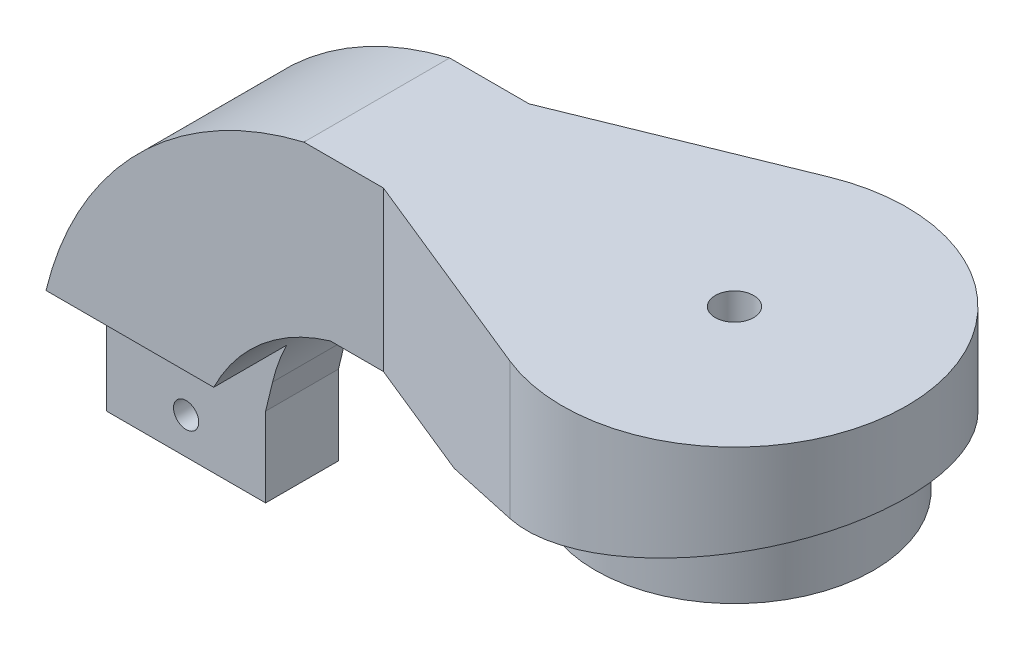
ISO-10303-21;
HEADER;
FILE_DESCRIPTION(('STEP AP214'),'2;1');
FILE_NAME('part.step','',(''),(''),'','','');
FILE_SCHEMA(('AUTOMOTIVE_DESIGN { 1 0 10303 214 1 1 1 1 }'));
ENDSEC;
DATA;
#1=APPLICATION_CONTEXT('core data for automotive mechanical design processes');
#2=APPLICATION_PROTOCOL_DEFINITION('international standard','automotive_design',2000,#1);
#3=PRODUCT_CONTEXT('',#1,'mechanical');
#4=PRODUCT('Part','Part','',(#3));
#5=PRODUCT_RELATED_PRODUCT_CATEGORY('part','',(#4));
#6=PRODUCT_DEFINITION_FORMATION('','',#4);
#7=PRODUCT_DEFINITION_CONTEXT('part definition',#1,'design');
#8=PRODUCT_DEFINITION('design','',#6,#7);
#9=PRODUCT_DEFINITION_SHAPE('','',#8);
#10=(LENGTH_UNIT() NAMED_UNIT(*) SI_UNIT(.MILLI.,.METRE.));
#11=(NAMED_UNIT(*) PLANE_ANGLE_UNIT() SI_UNIT($,.RADIAN.));
#12=(NAMED_UNIT(*) SI_UNIT($,.STERADIAN.) SOLID_ANGLE_UNIT());
#13=UNCERTAINTY_MEASURE_WITH_UNIT(LENGTH_MEASURE(1.E-05),#10,'distance_accuracy_value','');
#14=(GEOMETRIC_REPRESENTATION_CONTEXT(3) GLOBAL_UNCERTAINTY_ASSIGNED_CONTEXT((#13)) GLOBAL_UNIT_ASSIGNED_CONTEXT((#10,
#11,#12)) REPRESENTATION_CONTEXT('',''));
#15=CARTESIAN_POINT('',(0.,0.,0.));
#16=DIRECTION('',(0.,0.,1.));
#17=DIRECTION('',(1.,0.,0.));
#18=AXIS2_PLACEMENT_3D('',#15,#16,#17);
#19=CARTESIAN_POINT('',(-42.,24.,11.));
#20=DIRECTION('',(0.376404535641538,0.,-0.926455409368675));
#21=DIRECTION('',(-0.926455409368675,0.,-0.376404535641538));
#22=AXIS2_PLACEMENT_3D('',#19,#20,#21);
#23=PLANE('',#22);
#24=DIRECTION('',(0.926455409368675,0.,0.376404535641538));
#25=VECTOR('',#24,1.);
#26=CARTESIAN_POINT('',(-42.,0.,11.));
#27=LINE('',#26,#25);
#28=CARTESIAN_POINT('',(-42.,0.,11.));
#29=VERTEX_POINT('',#28);
#30=CARTESIAN_POINT('',(-24.,0.,18.3131222215699));
#31=VERTEX_POINT('',#30);
#32=EDGE_CURVE('E322',#29,#31,#27,.T.);
#33=ORIENTED_EDGE('',*,*,#32,.T.);
#34=DIRECTION('',(0.904369439054215,0.217048665373012,0.367431346736448));
#35=VECTOR('',#34,1.);
#36=CARTESIAN_POINT('',(-36.4410054694558,-2.98584131266938,13.258533690606));
#37=LINE('',#36,#35);
#38=CARTESIAN_POINT('',(-9.78651792667998,3.41123569759681,24.0878406435855));
#39=VERTEX_POINT('',#38);
#40=EDGE_CURVE('E57',#31,#39,#37,.T.);
#41=ORIENTED_EDGE('',*,*,#40,.T.);
#42=DIRECTION('',(0.,-1.,0.));
#43=VECTOR('',#42,1.);
#44=CARTESIAN_POINT('',(-9.78651792667998,24.,24.0878406435855));
#45=LINE('',#44,#43);
#46=CARTESIAN_POINT('',(-9.78651792667998,24.,24.0878406435855));
#47=VERTEX_POINT('',#46);
#48=EDGE_CURVE('E339',#47,#39,#45,.T.);
#49=ORIENTED_EDGE('',*,*,#48,.F.);
#50=DIRECTION('',(0.926455409368675,0.,0.376404535641538));
#51=VECTOR('',#50,1.);
#52=CARTESIAN_POINT('',(-42.,24.,11.));
#53=LINE('',#52,#51);
#54=CARTESIAN_POINT('',(-42.,24.,11.));
#55=VERTEX_POINT('',#54);
#56=EDGE_CURVE('E323',#55,#47,#53,.T.);
#57=ORIENTED_EDGE('',*,*,#56,.F.);
#58=DIRECTION('',(0.,-1.,0.));
#59=VECTOR('',#58,1.);
#60=CARTESIAN_POINT('',(-42.,24.,11.));
#61=LINE('',#60,#59);
#62=EDGE_CURVE('E42',#55,#29,#61,.T.);
#63=ORIENTED_EDGE('',*,*,#62,.T.);
#64=EDGE_LOOP('',(#33,#41,#49,#57,#63));
#65=FACE_BOUND('',#64,.T.);
#66=ADVANCED_FACE('F34',(#65),#23,.F.);
#67=CARTESIAN_POINT('',(0.,24.,0.));
#68=DIRECTION('',(0.,-1.,0.));
#69=DIRECTION('',(0.,0.,-1.));
#70=AXIS2_PLACEMENT_3D('',#67,#68,#69);
#71=CYLINDRICAL_SURFACE('',#70,26.);
#72=ORIENTED_EDGE('',*,*,#48,.T.);
#73=CARTESIAN_POINT('',(0.,5.76,0.));
#74=DIRECTION('',(-0.233372952475324,0.972387301980517,0.));
#75=DIRECTION('',(-0.972387301980518,-0.233372952475324,0.));
#76=AXIS2_PLACEMENT_3D('',#73,#74,#75);
#77=ELLIPSE('',#76,26.7383170749395,26.);
#78=CARTESIAN_POINT('',(-9.78651792667997,3.4112356975968,-24.0878406435855));
#79=VERTEX_POINT('',#78);
#80=EDGE_CURVE('E319',#39,#79,#77,.T.);
#81=ORIENTED_EDGE('',*,*,#80,.T.);
#82=DIRECTION('',(0.,-1.,0.));
#83=VECTOR('',#82,1.);
#84=CARTESIAN_POINT('',(-9.78651792667998,24.,-24.0878406435855));
#85=LINE('',#84,#83);
#86=CARTESIAN_POINT('',(-9.78651792667998,24.,-24.0878406435855));
#87=VERTEX_POINT('',#86);
#88=EDGE_CURVE('E336',#87,#79,#85,.T.);
#89=ORIENTED_EDGE('',*,*,#88,.F.);
#90=CARTESIAN_POINT('',(0.,24.,0.));
#91=DIRECTION('',(0.,1.,0.));
#92=DIRECTION('',(0.,0.,1.));
#93=AXIS2_PLACEMENT_3D('',#90,#91,#92);
#94=CIRCLE('',#93,26.);
#95=EDGE_CURVE('E325',#47,#87,#94,.T.);
#96=ORIENTED_EDGE('',*,*,#95,.F.);
#97=EDGE_LOOP('',(#72,#81,#89,#96));
#98=FACE_BOUND('',#97,.T.);
#99=ADVANCED_FACE('F369',(#98),#71,.T.);
#100=CARTESIAN_POINT('',(-42.,24.,-11.));
#101=DIRECTION('',(0.376404535641538,0.,0.926455409368675));
#102=DIRECTION('',(0.926455409368675,0.,-0.376404535641538));
#103=AXIS2_PLACEMENT_3D('',#100,#101,#102);
#104=PLANE('',#103);
#105=ORIENTED_EDGE('',*,*,#88,.T.);
#106=DIRECTION('',(-0.904369439054215,-0.217048665373012,0.367431346736448));
#107=VECTOR('',#106,1.);
#108=CARTESIAN_POINT('',(-36.4410054694558,-2.98584131266938,-13.258533690606));
#109=LINE('',#108,#107);
#110=CARTESIAN_POINT('',(-24.,0.,-18.3131222215699));
#111=VERTEX_POINT('',#110);
#112=EDGE_CURVE('E316',#79,#111,#109,.T.);
#113=ORIENTED_EDGE('',*,*,#112,.T.);
#114=DIRECTION('',(-0.926455409368675,0.,0.376404535641538));
#115=VECTOR('',#114,1.);
#116=CARTESIAN_POINT('',(-42.,0.,-11.));
#117=LINE('',#116,#115);
#118=CARTESIAN_POINT('',(-42.,0.,-11.));
#119=VERTEX_POINT('',#118);
#120=EDGE_CURVE('E326',#111,#119,#117,.T.);
#121=ORIENTED_EDGE('',*,*,#120,.T.);
#122=DIRECTION('',(0.,-1.,0.));
#123=VECTOR('',#122,1.);
#124=CARTESIAN_POINT('',(-42.,24.,-11.));
#125=LINE('',#124,#123);
#126=CARTESIAN_POINT('',(-42.,24.,-11.));
#127=VERTEX_POINT('',#126);
#128=EDGE_CURVE('E330',#127,#119,#125,.T.);
#129=ORIENTED_EDGE('',*,*,#128,.F.);
#130=DIRECTION('',(-0.926455409368675,0.,0.376404535641538));
#131=VECTOR('',#130,1.);
#132=CARTESIAN_POINT('',(-42.,24.,-11.));
#133=LINE('',#132,#131);
#134=EDGE_CURVE('E328',#87,#127,#133,.T.);
#135=ORIENTED_EDGE('',*,*,#134,.F.);
#136=EDGE_LOOP('',(#105,#113,#121,#129,#135));
#137=FACE_BOUND('',#136,.T.);
#138=ADVANCED_FACE('F363',(#137),#104,.F.);
#139=CARTESIAN_POINT('',(0.,24.,0.));
#140=DIRECTION('',(0.,1.,0.));
#141=DIRECTION('',(0.,0.,1.));
#142=AXIS2_PLACEMENT_3D('',#139,#140,#141);
#143=PLANE('',#142);
#144=CARTESIAN_POINT('',(0.,24.,0.));
#145=DIRECTION('',(0.,1.,0.));
#146=DIRECTION('',(0.,0.,1.));
#147=AXIS2_PLACEMENT_3D('',#144,#145,#146);
#148=CIRCLE('',#147,2.9);
#149=CARTESIAN_POINT('',(0.,24.,2.9));
#150=VERTEX_POINT('',#149);
#151=EDGE_CURVE('E217',#150,#150,#148,.T.);
#152=ORIENTED_EDGE('',*,*,#151,.F.);
#153=EDGE_LOOP('',(#152));
#154=FACE_BOUND('',#153,.T.);
#155=ORIENTED_EDGE('',*,*,#134,.T.);
#156=DIRECTION('',(-1.,0.,0.));
#157=VECTOR('',#156,1.);
#158=CARTESIAN_POINT('',(0.,24.,-11.));
#159=LINE('',#158,#157);
#160=CARTESIAN_POINT('',(-54.,24.,-11.));
#161=VERTEX_POINT('',#160);
#162=EDGE_CURVE('E226',#127,#161,#159,.T.);
#163=ORIENTED_EDGE('',*,*,#162,.T.);
#164=DIRECTION('',(0.,0.,-1.));
#165=VECTOR('',#164,1.);
#166=CARTESIAN_POINT('',(-54.,24.,11.));
#167=LINE('',#166,#165);
#168=CARTESIAN_POINT('',(-54.,24.,11.));
#169=VERTEX_POINT('',#168);
#170=EDGE_CURVE('E233',#169,#161,#167,.T.);
#171=ORIENTED_EDGE('',*,*,#170,.F.);
#172=DIRECTION('',(-1.,0.,0.));
#173=VECTOR('',#172,1.);
#174=CARTESIAN_POINT('',(0.,24.,11.));
#175=LINE('',#174,#173);
#176=EDGE_CURVE('E231',#55,#169,#175,.T.);
#177=ORIENTED_EDGE('',*,*,#176,.F.);
#178=ORIENTED_EDGE('',*,*,#56,.T.);
#179=ORIENTED_EDGE('',*,*,#95,.T.);
#180=EDGE_LOOP('',(#155,#163,#171,#177,#178,#179));
#181=FACE_BOUND('',#180,.T.);
#182=ADVANCED_FACE('F371',(#154,#181),#143,.T.);
#183=CARTESIAN_POINT('',(0.,0.,0.));
#184=DIRECTION('',(0.,1.,0.));
#185=DIRECTION('',(0.,0.,1.));
#186=AXIS2_PLACEMENT_3D('',#183,#184,#185);
#187=PLANE('',#186);
#188=ORIENTED_EDGE('',*,*,#120,.F.);
#189=DIRECTION('',(0.,0.,1.));
#190=VECTOR('',#189,1.);
#191=CARTESIAN_POINT('',(-24.,0.,0.));
#192=LINE('',#191,#190);
#193=EDGE_CURVE('E11',#111,#31,#192,.T.);
#194=ORIENTED_EDGE('',*,*,#193,.T.);
#195=ORIENTED_EDGE('',*,*,#32,.F.);
#196=DIRECTION('',(-1.,0.,0.));
#197=VECTOR('',#196,1.);
#198=CARTESIAN_POINT('',(0.,0.,11.));
#199=LINE('',#198,#197);
#200=CARTESIAN_POINT('',(-50.,0.,11.));
#201=VERTEX_POINT('',#200);
#202=EDGE_CURVE('E228',#29,#201,#199,.T.);
#203=ORIENTED_EDGE('',*,*,#202,.T.);
#204=DIRECTION('',(0.,0.,-1.));
#205=VECTOR('',#204,1.);
#206=CARTESIAN_POINT('',(-50.,0.,11.));
#207=LINE('',#206,#205);
#208=CARTESIAN_POINT('',(-50.,0.,-11.));
#209=VERTEX_POINT('',#208);
#210=EDGE_CURVE('E257',#201,#209,#207,.T.);
#211=ORIENTED_EDGE('',*,*,#210,.T.);
#212=DIRECTION('',(-1.,0.,0.));
#213=VECTOR('',#212,1.);
#214=CARTESIAN_POINT('',(0.,0.,-11.));
#215=LINE('',#214,#213);
#216=EDGE_CURVE('E251',#119,#209,#215,.T.);
#217=ORIENTED_EDGE('',*,*,#216,.F.);
#218=EDGE_LOOP('',(#188,#194,#195,#203,#211,#217));
#219=FACE_BOUND('',#218,.T.);
#220=ADVANCED_FACE('F351',(#219),#187,.F.);
#221=CARTESIAN_POINT('',(-24.,0.,-29.5));
#222=DIRECTION('',(-0.233372952475324,0.972387301980517,0.));
#223=DIRECTION('',(-0.972387301980518,-0.233372952475324,0.));
#224=AXIS2_PLACEMENT_3D('',#221,#222,#223);
#225=PLANE('',#224);
#226=CARTESIAN_POINT('',(0.,5.76,0.));
#227=DIRECTION('',(-0.233372952475324,0.972387301980517,0.));
#228=DIRECTION('',(0.972387301980518,0.233372952475324,0.));
#229=AXIS2_PLACEMENT_3D('',#226,#227,#228);
#230=ELLIPSE('',#229,21.5963330220665,21.);
#231=CARTESIAN_POINT('',(21.,10.8,0.));
#232=VERTEX_POINT('',#231);
#233=EDGE_CURVE('E37',#232,#232,#230,.T.);
#234=ORIENTED_EDGE('',*,*,#233,.T.);
#235=EDGE_LOOP('',(#234));
#236=FACE_BOUND('',#235,.T.);
#237=ORIENTED_EDGE('',*,*,#193,.F.);
#238=ORIENTED_EDGE('',*,*,#112,.F.);
#239=ORIENTED_EDGE('',*,*,#80,.F.);
#240=ORIENTED_EDGE('',*,*,#40,.F.);
#241=EDGE_LOOP('',(#237,#238,#239,#240));
#242=FACE_BOUND('',#241,.T.);
#243=ADVANCED_FACE('F366',(#236,#242),#225,.F.);
#244=CARTESIAN_POINT('',(0.,0.,0.));
#245=DIRECTION('',(0.,1.,0.));
#246=DIRECTION('',(0.,0.,1.));
#247=AXIS2_PLACEMENT_3D('',#244,#245,#246);
#248=CYLINDRICAL_SURFACE('',#247,21.);
#249=CARTESIAN_POINT('',(0.,0.,0.));
#250=DIRECTION('',(0.,1.,0.));
#251=DIRECTION('',(0.,0.,1.));
#252=AXIS2_PLACEMENT_3D('',#249,#250,#251);
#253=CIRCLE('',#252,21.);
#254=CARTESIAN_POINT('',(0.,0.,21.));
#255=VERTEX_POINT('',#254);
#256=EDGE_CURVE('E304',#255,#255,#253,.T.);
#257=ORIENTED_EDGE('',*,*,#256,.T.);
#258=EDGE_LOOP('',(#257));
#259=FACE_BOUND('',#258,.T.);
#260=ORIENTED_EDGE('',*,*,#233,.F.);
#261=EDGE_LOOP('',(#260));
#262=FACE_BOUND('',#261,.T.);
#263=ADVANCED_FACE('F422',(#259,#262),#248,.T.);
#264=CARTESIAN_POINT('',(0.,0.,0.));
#265=DIRECTION('',(0.,1.,0.));
#266=DIRECTION('',(0.,0.,1.));
#267=AXIS2_PLACEMENT_3D('',#264,#265,#266);
#268=PLANE('',#267);
#269=DIRECTION('',(-1.,0.,0.));
#270=VECTOR('',#269,1.);
#271=CARTESIAN_POINT('',(2.82901631902917,0.,4.9));
#272=LINE('',#271,#270);
#273=CARTESIAN_POINT('',(2.82901631902917,0.,4.9));
#274=VERTEX_POINT('',#273);
#275=CARTESIAN_POINT('',(-2.82901631902917,0.,4.9));
#276=VERTEX_POINT('',#275);
#277=EDGE_CURVE('E288',#274,#276,#272,.T.);
#278=ORIENTED_EDGE('',*,*,#277,.F.);
#279=DIRECTION('',(-0.5,0.,0.866025403784439));
#280=VECTOR('',#279,1.);
#281=CARTESIAN_POINT('',(5.65803263805833,0.,0.));
#282=LINE('',#281,#280);
#283=CARTESIAN_POINT('',(5.65803263805833,0.,0.));
#284=VERTEX_POINT('',#283);
#285=EDGE_CURVE('E49',#284,#274,#282,.T.);
#286=ORIENTED_EDGE('',*,*,#285,.F.);
#287=DIRECTION('',(0.5,0.,0.866025403784439));
#288=VECTOR('',#287,1.);
#289=CARTESIAN_POINT('',(2.82901631902916,0.,-4.9));
#290=LINE('',#289,#288);
#291=CARTESIAN_POINT('',(2.82901631902916,0.,-4.9));
#292=VERTEX_POINT('',#291);
#293=EDGE_CURVE('E271',#292,#284,#290,.T.);
#294=ORIENTED_EDGE('',*,*,#293,.F.);
#295=DIRECTION('',(1.,0.,0.));
#296=VECTOR('',#295,1.);
#297=CARTESIAN_POINT('',(-2.82901631902917,0.,-4.9));
#298=LINE('',#297,#296);
#299=CARTESIAN_POINT('',(-2.82901631902917,0.,-4.9));
#300=VERTEX_POINT('',#299);
#301=EDGE_CURVE('E297',#300,#292,#298,.T.);
#302=ORIENTED_EDGE('',*,*,#301,.F.);
#303=DIRECTION('',(0.5,0.,-0.866025403784439));
#304=VECTOR('',#303,1.);
#305=CARTESIAN_POINT('',(-5.65803263805833,0.,0.));
#306=LINE('',#305,#304);
#307=CARTESIAN_POINT('',(-5.65803263805833,0.,0.));
#308=VERTEX_POINT('',#307);
#309=EDGE_CURVE('E294',#308,#300,#306,.T.);
#310=ORIENTED_EDGE('',*,*,#309,.F.);
#311=DIRECTION('',(-0.5,0.,-0.866025403784439));
#312=VECTOR('',#311,1.);
#313=CARTESIAN_POINT('',(-2.82901631902917,0.,4.9));
#314=LINE('',#313,#312);
#315=EDGE_CURVE('E291',#276,#308,#314,.T.);
#316=ORIENTED_EDGE('',*,*,#315,.F.);
#317=EDGE_LOOP('',(#278,#286,#294,#302,#310,#316));
#318=FACE_BOUND('',#317,.T.);
#319=ORIENTED_EDGE('',*,*,#256,.F.);
#320=EDGE_LOOP('',(#319));
#321=FACE_BOUND('',#320,.T.);
#322=ADVANCED_FACE('F426',(#318,#321),#268,.F.);
#323=CARTESIAN_POINT('',(5.65803263805833,4.,0.));
#324=DIRECTION('',(0.866025403784439,0.,0.5));
#325=DIRECTION('',(0.5,0.,-0.866025403784439));
#326=AXIS2_PLACEMENT_3D('',#323,#324,#325);
#327=PLANE('',#326);
#328=ORIENTED_EDGE('',*,*,#285,.T.);
#329=DIRECTION('',(0.,-1.,0.));
#330=VECTOR('',#329,1.);
#331=CARTESIAN_POINT('',(2.82901631902917,4.,4.9));
#332=LINE('',#331,#330);
#333=CARTESIAN_POINT('',(2.82901631902917,4.,4.9));
#334=VERTEX_POINT('',#333);
#335=EDGE_CURVE('E286',#334,#274,#332,.T.);
#336=ORIENTED_EDGE('',*,*,#335,.F.);
#337=DIRECTION('',(-0.5,0.,0.866025403784439));
#338=VECTOR('',#337,1.);
#339=CARTESIAN_POINT('',(5.65803263805833,4.,0.));
#340=LINE('',#339,#338);
#341=CARTESIAN_POINT('',(5.65803263805833,4.,0.));
#342=VERTEX_POINT('',#341);
#343=EDGE_CURVE('E267',#342,#334,#340,.T.);
#344=ORIENTED_EDGE('',*,*,#343,.F.);
#345=DIRECTION('',(0.,-1.,0.));
#346=VECTOR('',#345,1.);
#347=CARTESIAN_POINT('',(5.65803263805833,4.,0.));
#348=LINE('',#347,#346);
#349=EDGE_CURVE('E302',#342,#284,#348,.T.);
#350=ORIENTED_EDGE('',*,*,#349,.T.);
#351=EDGE_LOOP('',(#328,#336,#344,#350));
#352=FACE_BOUND('',#351,.T.);
#353=ADVANCED_FACE('F430',(#352),#327,.F.);
#354=CARTESIAN_POINT('',(2.82901631902916,4.,-4.9));
#355=DIRECTION('',(0.866025403784439,0.,-0.5));
#356=DIRECTION('',(-0.5,0.,-0.866025403784439));
#357=AXIS2_PLACEMENT_3D('',#354,#355,#356);
#358=PLANE('',#357);
#359=ORIENTED_EDGE('',*,*,#293,.T.);
#360=ORIENTED_EDGE('',*,*,#349,.F.);
#361=DIRECTION('',(0.5,0.,0.866025403784439));
#362=VECTOR('',#361,1.);
#363=CARTESIAN_POINT('',(2.82901631902916,4.,-4.9));
#364=LINE('',#363,#362);
#365=CARTESIAN_POINT('',(2.82901631902916,4.,-4.9));
#366=VERTEX_POINT('',#365);
#367=EDGE_CURVE('E283',#366,#342,#364,.T.);
#368=ORIENTED_EDGE('',*,*,#367,.F.);
#369=DIRECTION('',(0.,-1.,0.));
#370=VECTOR('',#369,1.);
#371=CARTESIAN_POINT('',(2.82901631902916,4.,-4.9));
#372=LINE('',#371,#370);
#373=EDGE_CURVE('E305',#366,#292,#372,.T.);
#374=ORIENTED_EDGE('',*,*,#373,.T.);
#375=EDGE_LOOP('',(#359,#360,#368,#374));
#376=FACE_BOUND('',#375,.T.);
#377=ADVANCED_FACE('F434',(#376),#358,.F.);
#378=CARTESIAN_POINT('',(-2.82901631902917,4.,-4.9));
#379=DIRECTION('',(0.,0.,-1.));
#380=DIRECTION('',(-1.,0.,0.));
#381=AXIS2_PLACEMENT_3D('',#378,#379,#380);
#382=PLANE('',#381);
#383=ORIENTED_EDGE('',*,*,#301,.T.);
#384=ORIENTED_EDGE('',*,*,#373,.F.);
#385=DIRECTION('',(1.,0.,0.));
#386=VECTOR('',#385,1.);
#387=CARTESIAN_POINT('',(-2.82901631902917,4.,-4.9));
#388=LINE('',#387,#386);
#389=CARTESIAN_POINT('',(-2.82901631902917,4.,-4.9));
#390=VERTEX_POINT('',#389);
#391=EDGE_CURVE('E280',#390,#366,#388,.T.);
#392=ORIENTED_EDGE('',*,*,#391,.F.);
#393=DIRECTION('',(0.,-1.,0.));
#394=VECTOR('',#393,1.);
#395=CARTESIAN_POINT('',(-2.82901631902917,4.,-4.9));
#396=LINE('',#395,#394);
#397=EDGE_CURVE('E307',#390,#300,#396,.T.);
#398=ORIENTED_EDGE('',*,*,#397,.T.);
#399=EDGE_LOOP('',(#383,#384,#392,#398));
#400=FACE_BOUND('',#399,.T.);
#401=ADVANCED_FACE('F447',(#400),#382,.F.);
#402=CARTESIAN_POINT('',(-5.65803263805833,4.,0.));
#403=DIRECTION('',(-0.866025403784439,0.,-0.5));
#404=DIRECTION('',(-0.5,0.,0.866025403784439));
#405=AXIS2_PLACEMENT_3D('',#402,#403,#404);
#406=PLANE('',#405);
#407=ORIENTED_EDGE('',*,*,#309,.T.);
#408=ORIENTED_EDGE('',*,*,#397,.F.);
#409=DIRECTION('',(0.5,0.,-0.866025403784439));
#410=VECTOR('',#409,1.);
#411=CARTESIAN_POINT('',(-5.65803263805833,4.,0.));
#412=LINE('',#411,#410);
#413=CARTESIAN_POINT('',(-5.65803263805833,4.,0.));
#414=VERTEX_POINT('',#413);
#415=EDGE_CURVE('E277',#414,#390,#412,.T.);
#416=ORIENTED_EDGE('',*,*,#415,.F.);
#417=DIRECTION('',(0.,-1.,0.));
#418=VECTOR('',#417,1.);
#419=CARTESIAN_POINT('',(-5.65803263805833,4.,0.));
#420=LINE('',#419,#418);
#421=EDGE_CURVE('E309',#414,#308,#420,.T.);
#422=ORIENTED_EDGE('',*,*,#421,.T.);
#423=EDGE_LOOP('',(#407,#408,#416,#422));
#424=FACE_BOUND('',#423,.T.);
#425=ADVANCED_FACE('F443',(#424),#406,.F.);
#426=CARTESIAN_POINT('',(-2.82901631902917,4.,4.9));
#427=DIRECTION('',(-0.866025403784439,0.,0.5));
#428=DIRECTION('',(0.5,0.,0.866025403784439));
#429=AXIS2_PLACEMENT_3D('',#426,#427,#428);
#430=PLANE('',#429);
#431=ORIENTED_EDGE('',*,*,#315,.T.);
#432=ORIENTED_EDGE('',*,*,#421,.F.);
#433=DIRECTION('',(-0.5,0.,-0.866025403784439));
#434=VECTOR('',#433,1.);
#435=CARTESIAN_POINT('',(-2.82901631902917,4.,4.9));
#436=LINE('',#435,#434);
#437=CARTESIAN_POINT('',(-2.82901631902917,4.,4.9));
#438=VERTEX_POINT('',#437);
#439=EDGE_CURVE('E274',#438,#414,#436,.T.);
#440=ORIENTED_EDGE('',*,*,#439,.F.);
#441=DIRECTION('',(0.,-1.,0.));
#442=VECTOR('',#441,1.);
#443=CARTESIAN_POINT('',(-2.82901631902917,4.,4.9));
#444=LINE('',#443,#442);
#445=EDGE_CURVE('E311',#438,#276,#444,.T.);
#446=ORIENTED_EDGE('',*,*,#445,.T.);
#447=EDGE_LOOP('',(#431,#432,#440,#446));
#448=FACE_BOUND('',#447,.T.);
#449=ADVANCED_FACE('F439',(#448),#430,.F.);
#450=CARTESIAN_POINT('',(2.82901631902917,4.,4.9));
#451=DIRECTION('',(0.,0.,1.));
#452=DIRECTION('',(1.,0.,0.));
#453=AXIS2_PLACEMENT_3D('',#450,#451,#452);
#454=PLANE('',#453);
#455=ORIENTED_EDGE('',*,*,#277,.T.);
#456=ORIENTED_EDGE('',*,*,#445,.F.);
#457=DIRECTION('',(-1.,0.,0.));
#458=VECTOR('',#457,1.);
#459=CARTESIAN_POINT('',(2.82901631902917,4.,4.9));
#460=LINE('',#459,#458);
#461=EDGE_CURVE('E270',#334,#438,#460,.T.);
#462=ORIENTED_EDGE('',*,*,#461,.F.);
#463=ORIENTED_EDGE('',*,*,#335,.T.);
#464=EDGE_LOOP('',(#455,#456,#462,#463));
#465=FACE_BOUND('',#464,.T.);
#466=ADVANCED_FACE('F435',(#465),#454,.F.);
#467=CARTESIAN_POINT('',(0.,4.,0.));
#468=DIRECTION('',(0.,-1.,0.));
#469=DIRECTION('',(0.,0.,-1.));
#470=AXIS2_PLACEMENT_3D('',#467,#468,#469);
#471=PLANE('',#470);
#472=CARTESIAN_POINT('',(0.,4.,0.));
#473=DIRECTION('',(0.,-1.,0.));
#474=DIRECTION('',(0.,0.,-1.));
#475=AXIS2_PLACEMENT_3D('',#472,#473,#474);
#476=CIRCLE('',#475,2.9);
#477=CARTESIAN_POINT('',(0.,4.,-2.9));
#478=VERTEX_POINT('',#477);
#479=EDGE_CURVE('E216',#478,#478,#476,.F.);
#480=ORIENTED_EDGE('',*,*,#479,.T.);
#481=EDGE_LOOP('',(#480));
#482=FACE_BOUND('',#481,.T.);
#483=ORIENTED_EDGE('',*,*,#343,.T.);
#484=ORIENTED_EDGE('',*,*,#461,.T.);
#485=ORIENTED_EDGE('',*,*,#439,.T.);
#486=ORIENTED_EDGE('',*,*,#415,.T.);
#487=ORIENTED_EDGE('',*,*,#391,.T.);
#488=ORIENTED_EDGE('',*,*,#367,.T.);
#489=EDGE_LOOP('',(#483,#484,#485,#486,#487,#488));
#490=FACE_BOUND('',#489,.T.);
#491=ADVANCED_FACE('F438',(#482,#490),#471,.T.);
#492=CARTESIAN_POINT('',(-41.7095894033961,-27.2551559973421,11.));
#493=DIRECTION('',(0.,0.,-1.));
#494=DIRECTION('',(-1.,0.,0.));
#495=AXIS2_PLACEMENT_3D('',#492,#493,#494);
#496=CYLINDRICAL_SURFACE('',#495,52.7081133123259);
#497=CARTESIAN_POINT('',(-41.7095894033961,-27.2551559973421,-11.));
#498=DIRECTION('',(0.,0.,1.));
#499=DIRECTION('',(1.,0.,0.));
#500=AXIS2_PLACEMENT_3D('',#497,#498,#499);
#501=CIRCLE('',#500,52.7081133123259);
#502=CARTESIAN_POINT('',(-92.9418253522618,-14.8695511019506,-11.));
#503=VERTEX_POINT('',#502);
#504=EDGE_CURVE('E220',#503,#161,#501,.F.);
#505=ORIENTED_EDGE('',*,*,#504,.F.);
#506=DIRECTION('',(0.,0.,-1.));
#507=VECTOR('',#506,1.);
#508=CARTESIAN_POINT('',(-92.9418253522618,-14.8695511019506,11.));
#509=LINE('',#508,#507);
#510=CARTESIAN_POINT('',(-92.9418253522618,-14.8695511019506,0.));
#511=VERTEX_POINT('',#510);
#512=EDGE_CURVE('E265',#511,#503,#509,.T.);
#513=ORIENTED_EDGE('',*,*,#512,.F.);
#514=CARTESIAN_POINT('',(-92.9418253522618,-14.8695511019506,11.));
#515=VERTEX_POINT('',#514);
#516=EDGE_CURVE('E179',#515,#511,#509,.T.);
#517=ORIENTED_EDGE('',*,*,#516,.F.);
#518=CARTESIAN_POINT('',(-41.7095894033961,-27.2551559973421,11.));
#519=DIRECTION('',(0.,0.,1.));
#520=DIRECTION('',(1.,0.,0.));
#521=AXIS2_PLACEMENT_3D('',#518,#519,#520);
#522=CIRCLE('',#521,52.7081133123259);
#523=EDGE_CURVE('E223',#515,#169,#522,.F.);
#524=ORIENTED_EDGE('',*,*,#523,.T.);
#525=ORIENTED_EDGE('',*,*,#170,.T.);
#526=EDGE_LOOP('',(#505,#513,#517,#524,#525));
#527=FACE_BOUND('',#526,.T.);
#528=ADVANCED_FACE('F375',(#527),#496,.T.);
#529=CARTESIAN_POINT('',(-84.4134977836503,20.4073121545938,11.));
#530=DIRECTION('',(0.971999047761113,-0.234984789191746,0.));
#531=DIRECTION('',(0.234984789191746,0.971999047761113,0.));
#532=AXIS2_PLACEMENT_3D('',#529,#530,#531);
#533=PLANE('',#532);
#534=DIRECTION('',(0.,0.,-1.));
#535=VECTOR('',#534,1.);
#536=CARTESIAN_POINT('',(-94.78651792668,-22.5,11.));
#537=LINE('',#536,#535);
#538=CARTESIAN_POINT('',(-94.78651792668,-22.5,0.));
#539=VERTEX_POINT('',#538);
#540=CARTESIAN_POINT('',(-94.78651792668,-22.5,-11.));
#541=VERTEX_POINT('',#540);
#542=EDGE_CURVE('E263',#539,#541,#537,.T.);
#543=ORIENTED_EDGE('',*,*,#542,.F.);
#544=DIRECTION('',(-0.234984789191746,-0.971999047761113,0.));
#545=VECTOR('',#544,1.);
#546=CARTESIAN_POINT('',(-86.374058126423,12.2975838917223,0.));
#547=LINE('',#546,#545);
#548=EDGE_CURVE('E210',#511,#539,#547,.T.);
#549=ORIENTED_EDGE('',*,*,#548,.F.);
#550=ORIENTED_EDGE('',*,*,#512,.T.);
#551=DIRECTION('',(-0.234984789191746,-0.971999047761113,0.));
#552=VECTOR('',#551,1.);
#553=CARTESIAN_POINT('',(-84.4134977836503,20.4073121545938,-11.));
#554=LINE('',#553,#552);
#555=EDGE_CURVE('E236',#503,#541,#554,.T.);
#556=ORIENTED_EDGE('',*,*,#555,.T.);
#557=EDGE_LOOP('',(#543,#549,#550,#556));
#558=FACE_BOUND('',#557,.T.);
#559=ADVANCED_FACE('F380',(#558),#533,.F.);
#560=CARTESIAN_POINT('',(-94.78651792668,0.,11.));
#561=DIRECTION('',(1.,0.,0.));
#562=DIRECTION('',(0.,0.,-1.));
#563=AXIS2_PLACEMENT_3D('',#560,#561,#562);
#564=PLANE('',#563);
#565=DIRECTION('',(0.,0.,-1.));
#566=VECTOR('',#565,1.);
#567=CARTESIAN_POINT('',(-94.78651792668,-37.0753078944646,11.));
#568=LINE('',#567,#566);
#569=CARTESIAN_POINT('',(-94.78651792668,-37.0753078944646,0.));
#570=VERTEX_POINT('',#569);
#571=CARTESIAN_POINT('',(-94.78651792668,-37.0753078944646,-11.));
#572=VERTEX_POINT('',#571);
#573=EDGE_CURVE('E196',#570,#572,#568,.T.);
#574=ORIENTED_EDGE('',*,*,#573,.F.);
#575=DIRECTION('',(0.,-1.,0.));
#576=VECTOR('',#575,1.);
#577=CARTESIAN_POINT('',(-94.78651792668,-14.8695511019506,0.));
#578=LINE('',#577,#576);
#579=EDGE_CURVE('E207',#539,#570,#578,.T.);
#580=ORIENTED_EDGE('',*,*,#579,.F.);
#581=ORIENTED_EDGE('',*,*,#542,.T.);
#582=DIRECTION('',(0.,-1.,0.));
#583=VECTOR('',#582,1.);
#584=CARTESIAN_POINT('',(-94.78651792668,0.,-11.));
#585=LINE('',#584,#583);
#586=EDGE_CURVE('E239',#541,#572,#585,.T.);
#587=ORIENTED_EDGE('',*,*,#586,.T.);
#588=EDGE_LOOP('',(#574,#580,#581,#587));
#589=FACE_BOUND('',#588,.T.);
#590=ADVANCED_FACE('F385',(#589),#564,.F.);
#591=CARTESIAN_POINT('',(-70.78651792668,0.,11.));
#592=DIRECTION('',(1.,0.,0.));
#593=DIRECTION('',(0.,0.,-1.));
#594=AXIS2_PLACEMENT_3D('',#591,#592,#593);
#595=PLANE('',#594);
#596=DIRECTION('',(0.,-1.,0.));
#597=VECTOR('',#596,1.);
#598=CARTESIAN_POINT('',(-70.78651792668,-14.8695511019506,0.));
#599=LINE('',#598,#597);
#600=CARTESIAN_POINT('',(-70.78651792668,-25.0753078944646,0.));
#601=VERTEX_POINT('',#600);
#602=CARTESIAN_POINT('',(-70.78651792668,-37.0753078944646,0.));
#603=VERTEX_POINT('',#602);
#604=EDGE_CURVE('E204',#601,#603,#599,.T.);
#605=ORIENTED_EDGE('',*,*,#604,.T.);
#606=DIRECTION('',(0.,0.,-1.));
#607=VECTOR('',#606,1.);
#608=CARTESIAN_POINT('',(-70.78651792668,-37.0753078944646,11.));
#609=LINE('',#608,#607);
#610=CARTESIAN_POINT('',(-70.78651792668,-37.0753078944646,-11.));
#611=VERTEX_POINT('',#610);
#612=EDGE_CURVE('E198',#603,#611,#609,.T.);
#613=ORIENTED_EDGE('',*,*,#612,.T.);
#614=DIRECTION('',(0.,-1.,0.));
#615=VECTOR('',#614,1.);
#616=CARTESIAN_POINT('',(-70.78651792668,0.,-11.));
#617=LINE('',#616,#615);
#618=CARTESIAN_POINT('',(-70.78651792668,-25.0753078944646,-11.));
#619=VERTEX_POINT('',#618);
#620=EDGE_CURVE('E242',#619,#611,#617,.T.);
#621=ORIENTED_EDGE('',*,*,#620,.F.);
#622=DIRECTION('',(0.,0.,-1.));
#623=VECTOR('',#622,1.);
#624=CARTESIAN_POINT('',(-70.78651792668,-25.0753078944646,11.));
#625=LINE('',#624,#623);
#626=EDGE_CURVE('E261',#601,#619,#625,.T.);
#627=ORIENTED_EDGE('',*,*,#626,.F.);
#628=EDGE_LOOP('',(#605,#613,#621,#627));
#629=FACE_BOUND('',#628,.T.);
#630=ADVANCED_FACE('F395',(#629),#595,.T.);
#631=CARTESIAN_POINT('',(-61.1505130339718,14.7833893946227,11.));
#632=DIRECTION('',(0.971999047761113,-0.234984789191746,0.));
#633=DIRECTION('',(0.234984789191746,0.971999047761113,0.));
#634=AXIS2_PLACEMENT_3D('',#631,#632,#633);
#635=PLANE('',#634);
#636=DIRECTION('',(-0.234984789191746,-0.971999047761113,0.));
#637=VECTOR('',#636,1.);
#638=CARTESIAN_POINT('',(-63.1110733767444,6.67366113175113,0.));
#639=LINE('',#638,#637);
#640=CARTESIAN_POINT('',(-69.7388628081069,-20.7417517475426,0.));
#641=VERTEX_POINT('',#640);
#642=EDGE_CURVE('E188',#641,#601,#639,.T.);
#643=ORIENTED_EDGE('',*,*,#642,.T.);
#644=ORIENTED_EDGE('',*,*,#626,.T.);
#645=DIRECTION('',(-0.234984789191746,-0.971999047761113,0.));
#646=VECTOR('',#645,1.);
#647=CARTESIAN_POINT('',(-61.1505130339718,14.7833893946227,-11.));
#648=LINE('',#647,#646);
#649=CARTESIAN_POINT('',(-69.7388628081069,-20.7417517475426,-11.));
#650=VERTEX_POINT('',#649);
#651=EDGE_CURVE('E245',#650,#619,#648,.T.);
#652=ORIENTED_EDGE('',*,*,#651,.F.);
#653=DIRECTION('',(0.,0.,-1.));
#654=VECTOR('',#653,1.);
#655=CARTESIAN_POINT('',(-69.7388628081069,-20.7417517475426,11.));
#656=LINE('',#655,#654);
#657=EDGE_CURVE('E259',#641,#650,#656,.T.);
#658=ORIENTED_EDGE('',*,*,#657,.F.);
#659=EDGE_LOOP('',(#643,#644,#652,#658));
#660=FACE_BOUND('',#659,.T.);
#661=ADVANCED_FACE('F397',(#660),#635,.T.);
#662=CARTESIAN_POINT('',(-41.8993681465749,-27.4720647034176,11.));
#663=DIRECTION('',(0.,0.,-1.));
#664=DIRECTION('',(-1.,0.,0.));
#665=AXIS2_PLACEMENT_3D('',#662,#663,#664);
#666=CYLINDRICAL_SURFACE('',#665,28.6414834722905);
#667=CARTESIAN_POINT('',(-41.8993681465749,-27.4720647034176,11.));
#668=DIRECTION('',(0.,0.,1.));
#669=DIRECTION('',(1.,0.,0.));
#670=AXIS2_PLACEMENT_3D('',#667,#668,#669);
#671=CIRCLE('',#670,28.6414834722905);
#672=CARTESIAN_POINT('',(-67.6192286908766,-14.8695511019506,11.));
#673=VERTEX_POINT('',#672);
#674=EDGE_CURVE('E195',#673,#201,#671,.F.);
#675=ORIENTED_EDGE('',*,*,#674,.F.);
#676=DIRECTION('',(0.,0.,-1.));
#677=VECTOR('',#676,1.);
#678=CARTESIAN_POINT('',(-67.6192286908766,-14.8695511019506,11.));
#679=LINE('',#678,#677);
#680=CARTESIAN_POINT('',(-67.6192286908766,-14.8695511019506,0.));
#681=VERTEX_POINT('',#680);
#682=EDGE_CURVE('E176',#681,#673,#679,.F.);
#683=ORIENTED_EDGE('',*,*,#682,.F.);
#684=CARTESIAN_POINT('',(-41.8993681465749,-27.4720647034176,0.));
#685=DIRECTION('',(0.,0.,-1.));
#686=DIRECTION('',(-1.,0.,0.));
#687=AXIS2_PLACEMENT_3D('',#684,#685,#686);
#688=CIRCLE('',#687,28.6414834722905);
#689=EDGE_CURVE('E185',#641,#681,#688,.T.);
#690=ORIENTED_EDGE('',*,*,#689,.F.);
#691=ORIENTED_EDGE('',*,*,#657,.T.);
#692=CARTESIAN_POINT('',(-41.8993681465749,-27.4720647034176,-11.));
#693=DIRECTION('',(0.,0.,1.));
#694=DIRECTION('',(1.,0.,0.));
#695=AXIS2_PLACEMENT_3D('',#692,#693,#694);
#696=CIRCLE('',#695,28.6414834722905);
#697=EDGE_CURVE('E248',#650,#209,#696,.F.);
#698=ORIENTED_EDGE('',*,*,#697,.T.);
#699=ORIENTED_EDGE('',*,*,#210,.F.);
#700=EDGE_LOOP('',(#675,#683,#690,#691,#698,#699));
#701=FACE_BOUND('',#700,.T.);
#702=ADVANCED_FACE('F193',(#701),#666,.F.);
#703=CARTESIAN_POINT('',(0.,0.,11.));
#704=DIRECTION('',(0.,0.,1.));
#705=DIRECTION('',(1.,0.,0.));
#706=AXIS2_PLACEMENT_3D('',#703,#704,#705);
#707=PLANE('',#706);
#708=DIRECTION('',(1.,0.,0.));
#709=VECTOR('',#708,1.);
#710=CARTESIAN_POINT('',(26.001,-14.8695511019506,11.));
#711=LINE('',#710,#709);
#712=EDGE_CURVE('E214',#515,#673,#711,.T.);
#713=ORIENTED_EDGE('',*,*,#712,.T.);
#714=ORIENTED_EDGE('',*,*,#674,.T.);
#715=ORIENTED_EDGE('',*,*,#202,.F.);
#716=ORIENTED_EDGE('',*,*,#62,.F.);
#717=ORIENTED_EDGE('',*,*,#176,.T.);
#718=ORIENTED_EDGE('',*,*,#523,.F.);
#719=EDGE_LOOP('',(#713,#714,#715,#716,#717,#718));
#720=FACE_BOUND('',#719,.T.);
#721=ADVANCED_FACE('F352',(#720),#707,.T.);
#722=CARTESIAN_POINT('',(0.,0.,-11.));
#723=DIRECTION('',(0.,0.,1.));
#724=DIRECTION('',(1.,0.,0.));
#725=AXIS2_PLACEMENT_3D('',#722,#723,#724);
#726=PLANE('',#725);
#727=CARTESIAN_POINT('',(-81.9601774293469,-20.3695511019506,-11.));
#728=DIRECTION('',(0.,0.,1.));
#729=DIRECTION('',(1.,0.,0.));
#730=AXIS2_PLACEMENT_3D('',#727,#728,#729);
#731=CIRCLE('',#730,1.9);
#732=CARTESIAN_POINT('',(-80.0601774293469,-20.3695511019506,-11.));
#733=VERTEX_POINT('',#732);
#734=EDGE_CURVE('E393',#733,#733,#731,.T.);
#735=ORIENTED_EDGE('',*,*,#734,.T.);
#736=EDGE_LOOP('',(#735));
#737=FACE_BOUND('',#736,.T.);
#738=CARTESIAN_POINT('',(-82.78651792668,-31.5753078944646,-11.));
#739=DIRECTION('',(0.,0.,1.));
#740=DIRECTION('',(1.,0.,0.));
#741=AXIS2_PLACEMENT_3D('',#738,#739,#740);
#742=CIRCLE('',#741,1.9);
#743=CARTESIAN_POINT('',(-80.88651792668,-31.5753078944646,-11.));
#744=VERTEX_POINT('',#743);
#745=EDGE_CURVE('E690',#744,#744,#742,.T.);
#746=ORIENTED_EDGE('',*,*,#745,.T.);
#747=EDGE_LOOP('',(#746));
#748=FACE_BOUND('',#747,.T.);
#749=ORIENTED_EDGE('',*,*,#620,.T.);
#750=DIRECTION('',(1.,0.,0.));
#751=VECTOR('',#750,1.);
#752=CARTESIAN_POINT('',(26.001,-37.0753078944646,-11.));
#753=LINE('',#752,#751);
#754=EDGE_CURVE('E212',#572,#611,#753,.T.);
#755=ORIENTED_EDGE('',*,*,#754,.F.);
#756=ORIENTED_EDGE('',*,*,#586,.F.);
#757=ORIENTED_EDGE('',*,*,#555,.F.);
#758=ORIENTED_EDGE('',*,*,#504,.T.);
#759=ORIENTED_EDGE('',*,*,#162,.F.);
#760=ORIENTED_EDGE('',*,*,#128,.T.);
#761=ORIENTED_EDGE('',*,*,#216,.T.);
#762=ORIENTED_EDGE('',*,*,#697,.F.);
#763=ORIENTED_EDGE('',*,*,#651,.T.);
#764=EDGE_LOOP('',(#749,#755,#756,#757,#758,#759,#760,#761,#762,#763));
#765=FACE_BOUND('',#764,.T.);
#766=ADVANCED_FACE('F357',(#737,#748,#765),#726,.F.);
#767=CARTESIAN_POINT('',(0.,-99.501,0.));
#768=DIRECTION('',(0.,1.,0.));
#769=DIRECTION('',(0.,0.,1.));
#770=AXIS2_PLACEMENT_3D('',#767,#768,#769);
#771=CYLINDRICAL_SURFACE('',#770,2.9);
#772=ORIENTED_EDGE('',*,*,#479,.F.);
#773=EDGE_LOOP('',(#772));
#774=FACE_BOUND('',#773,.T.);
#775=ORIENTED_EDGE('',*,*,#151,.T.);
#776=EDGE_LOOP('',(#775));
#777=FACE_BOUND('',#776,.T.);
#778=ADVANCED_FACE('F503',(#774,#777),#771,.F.);
#779=CARTESIAN_POINT('',(26.001,-14.8695511019506,34.5150950819672));
#780=DIRECTION('',(0.,1.,0.));
#781=DIRECTION('',(0.,0.,1.));
#782=AXIS2_PLACEMENT_3D('',#779,#780,#781);
#783=PLANE('',#782);
#784=ORIENTED_EDGE('',*,*,#516,.T.);
#785=DIRECTION('',(-1.,0.,0.));
#786=VECTOR('',#785,1.);
#787=CARTESIAN_POINT('',(26.001,-14.8695511019506,0.));
#788=LINE('',#787,#786);
#789=EDGE_CURVE('E172',#681,#511,#788,.T.);
#790=ORIENTED_EDGE('',*,*,#789,.F.);
#791=ORIENTED_EDGE('',*,*,#682,.T.);
#792=ORIENTED_EDGE('',*,*,#712,.F.);
#793=EDGE_LOOP('',(#784,#790,#791,#792));
#794=FACE_BOUND('',#793,.T.);
#795=ADVANCED_FACE('F174',(#794),#783,.F.);
#796=CARTESIAN_POINT('',(26.001,-37.0753078944646,0.));
#797=DIRECTION('',(0.,1.,0.));
#798=DIRECTION('',(0.,0.,1.));
#799=AXIS2_PLACEMENT_3D('',#796,#797,#798);
#800=PLANE('',#799);
#801=ORIENTED_EDGE('',*,*,#573,.T.);
#802=ORIENTED_EDGE('',*,*,#754,.T.);
#803=ORIENTED_EDGE('',*,*,#612,.F.);
#804=DIRECTION('',(-1.,0.,0.));
#805=VECTOR('',#804,1.);
#806=CARTESIAN_POINT('',(26.001,-37.0753078944646,0.));
#807=LINE('',#806,#805);
#808=EDGE_CURVE('E182',#603,#570,#807,.T.);
#809=ORIENTED_EDGE('',*,*,#808,.T.);
#810=EDGE_LOOP('',(#801,#802,#803,#809));
#811=FACE_BOUND('',#810,.T.);
#812=ADVANCED_FACE('F390',(#811),#800,.F.);
#813=CARTESIAN_POINT('',(26.001,-14.8695511019506,0.));
#814=DIRECTION('',(0.,0.,-1.));
#815=DIRECTION('',(-1.,0.,0.));
#816=AXIS2_PLACEMENT_3D('',#813,#814,#815);
#817=PLANE('',#816);
#818=CARTESIAN_POINT('',(-81.9601774293469,-20.3695511019506,0.));
#819=DIRECTION('',(0.,0.,1.));
#820=DIRECTION('',(1.,0.,0.));
#821=AXIS2_PLACEMENT_3D('',#818,#819,#820);
#822=CIRCLE('',#821,1.9);
#823=CARTESIAN_POINT('',(-80.0601774293469,-20.3695511019506,0.));
#824=VERTEX_POINT('',#823);
#825=EDGE_CURVE('E687',#824,#824,#822,.T.);
#826=ORIENTED_EDGE('',*,*,#825,.F.);
#827=EDGE_LOOP('',(#826));
#828=FACE_BOUND('',#827,.T.);
#829=CARTESIAN_POINT('',(-82.78651792668,-31.5753078944646,0.));
#830=DIRECTION('',(0.,0.,1.));
#831=DIRECTION('',(1.,0.,0.));
#832=AXIS2_PLACEMENT_3D('',#829,#830,#831);
#833=CIRCLE('',#832,1.9);
#834=CARTESIAN_POINT('',(-80.88651792668,-31.5753078944646,0.));
#835=VERTEX_POINT('',#834);
#836=EDGE_CURVE('E695',#835,#835,#833,.T.);
#837=ORIENTED_EDGE('',*,*,#836,.F.);
#838=EDGE_LOOP('',(#837));
#839=FACE_BOUND('',#838,.T.);
#840=ORIENTED_EDGE('',*,*,#548,.T.);
#841=ORIENTED_EDGE('',*,*,#579,.T.);
#842=ORIENTED_EDGE('',*,*,#808,.F.);
#843=ORIENTED_EDGE('',*,*,#604,.F.);
#844=ORIENTED_EDGE('',*,*,#642,.F.);
#845=ORIENTED_EDGE('',*,*,#689,.T.);
#846=ORIENTED_EDGE('',*,*,#789,.T.);
#847=EDGE_LOOP('',(#840,#841,#842,#843,#844,#845,#846));
#848=FACE_BOUND('',#847,.T.);
#849=ADVANCED_FACE('F186',(#828,#839,#848),#817,.F.);
#850=CARTESIAN_POINT('',(-82.78651792668,-31.5753078944646,-26.));
#851=DIRECTION('',(0.,0.,1.));
#852=DIRECTION('',(1.,0.,0.));
#853=AXIS2_PLACEMENT_3D('',#850,#851,#852);
#854=CYLINDRICAL_SURFACE('',#853,1.9);
#855=ORIENTED_EDGE('',*,*,#836,.T.);
#856=EDGE_LOOP('',(#855));
#857=FACE_BOUND('',#856,.T.);
#858=ORIENTED_EDGE('',*,*,#745,.F.);
#859=EDGE_LOOP('',(#858));
#860=FACE_BOUND('',#859,.T.);
#861=ADVANCED_FACE('F529',(#857,#860),#854,.F.);
#862=CARTESIAN_POINT('',(-81.9601774293469,-20.3695511019506,-26.));
#863=DIRECTION('',(0.,0.,1.));
#864=DIRECTION('',(1.,0.,0.));
#865=AXIS2_PLACEMENT_3D('',#862,#863,#864);
#866=CYLINDRICAL_SURFACE('',#865,1.9);
#867=ORIENTED_EDGE('',*,*,#825,.T.);
#868=EDGE_LOOP('',(#867));
#869=FACE_BOUND('',#868,.T.);
#870=ORIENTED_EDGE('',*,*,#734,.F.);
#871=EDGE_LOOP('',(#870));
#872=FACE_BOUND('',#871,.T.);
#873=ADVANCED_FACE('F539',(#869,#872),#866,.F.);
#874=CLOSED_SHELL('',(#66,#99,#138,#182,#220,#243,#263,#322,#353,#377,#401,#425,#449,#466,#491,
#528,#559,#590,#630,#661,#702,#721,#766,#778,#795,#812,#849,#861,#873));
#875=MANIFOLD_SOLID_BREP('B2',#874);
#876=ADVANCED_BREP_SHAPE_REPRESENTATION('',(#18,#875),#14);
#877=SHAPE_DEFINITION_REPRESENTATION(#9,#876);
ENDSEC;
END-ISO-10303-21;
